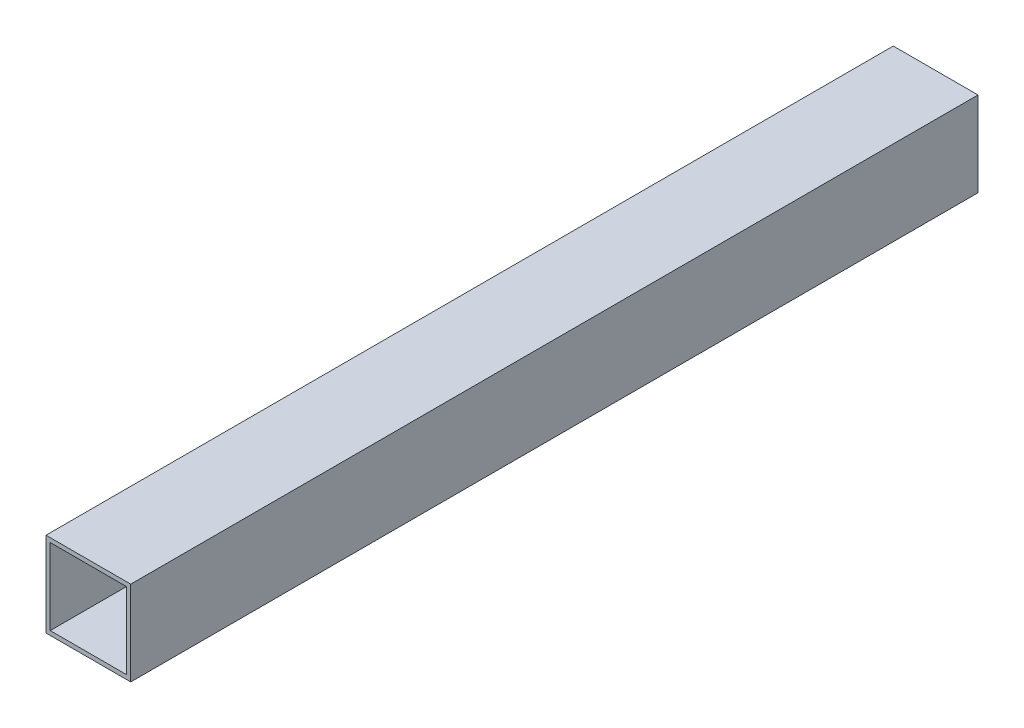
ISO-10303-21;
HEADER;
FILE_DESCRIPTION(('STEP AP214'),'2;1');
FILE_NAME('part.step','',(''),(''),'','','');
FILE_SCHEMA(('AUTOMOTIVE_DESIGN { 1 0 10303 214 1 1 1 1 }'));
ENDSEC;
DATA;
#1=APPLICATION_CONTEXT('core data for automotive mechanical design processes');
#2=APPLICATION_PROTOCOL_DEFINITION('international standard','automotive_design',2000,#1);
#3=PRODUCT_CONTEXT('',#1,'mechanical');
#4=PRODUCT('Part','Part','',(#3));
#5=PRODUCT_RELATED_PRODUCT_CATEGORY('part','',(#4));
#6=PRODUCT_DEFINITION_FORMATION('','',#4);
#7=PRODUCT_DEFINITION_CONTEXT('part definition',#1,'design');
#8=PRODUCT_DEFINITION('design','',#6,#7);
#9=PRODUCT_DEFINITION_SHAPE('','',#8);
#10=(LENGTH_UNIT() NAMED_UNIT(*) SI_UNIT(.MILLI.,.METRE.));
#11=(NAMED_UNIT(*) PLANE_ANGLE_UNIT() SI_UNIT($,.RADIAN.));
#12=(NAMED_UNIT(*) SI_UNIT($,.STERADIAN.) SOLID_ANGLE_UNIT());
#13=UNCERTAINTY_MEASURE_WITH_UNIT(LENGTH_MEASURE(1.E-05),#10,'distance_accuracy_value','');
#14=(GEOMETRIC_REPRESENTATION_CONTEXT(3) GLOBAL_UNCERTAINTY_ASSIGNED_CONTEXT((#13)) GLOBAL_UNIT_ASSIGNED_CONTEXT((#10,
#11,#12)) REPRESENTATION_CONTEXT('',''));
#15=CARTESIAN_POINT('',(0.,0.,0.));
#16=DIRECTION('',(0.,0.,1.));
#17=DIRECTION('',(1.,0.,0.));
#18=AXIS2_PLACEMENT_3D('',#15,#16,#17);
#19=CARTESIAN_POINT('',(0.,0.,500.));
#20=DIRECTION('',(0.,0.,-1.));
#21=DIRECTION('',(-1.,0.,0.));
#22=AXIS2_PLACEMENT_3D('',#19,#20,#21);
#23=PLANE('',#22);
#24=DIRECTION('',(0.,-1.,0.));
#25=VECTOR('',#24,1.);
#26=CARTESIAN_POINT('',(-50.,-50.,500.));
#27=LINE('',#26,#25);
#28=CARTESIAN_POINT('',(-50.,49.9999999999999,500.));
#29=VERTEX_POINT('',#28);
#30=CARTESIAN_POINT('',(-50.,-50.,500.));
#31=VERTEX_POINT('',#30);
#32=EDGE_CURVE('E139',#29,#31,#27,.T.);
#33=ORIENTED_EDGE('',*,*,#32,.T.);
#34=DIRECTION('',(1.,0.,0.));
#35=VECTOR('',#34,1.);
#36=CARTESIAN_POINT('',(-50.,-50.,500.));
#37=LINE('',#36,#35);
#38=CARTESIAN_POINT('',(50.,-50.,500.));
#39=VERTEX_POINT('',#38);
#40=EDGE_CURVE('E142',#31,#39,#37,.T.);
#41=ORIENTED_EDGE('',*,*,#40,.T.);
#42=DIRECTION('',(0.,1.,0.));
#43=VECTOR('',#42,1.);
#44=CARTESIAN_POINT('',(50.,-50.,500.));
#45=LINE('',#44,#43);
#46=CARTESIAN_POINT('',(49.9999999999999,49.9999999999999,500.));
#47=VERTEX_POINT('',#46);
#48=EDGE_CURVE('E147',#39,#47,#45,.T.);
#49=ORIENTED_EDGE('',*,*,#48,.T.);
#50=DIRECTION('',(-1.,0.,0.));
#51=VECTOR('',#50,1.);
#52=CARTESIAN_POINT('',(-50.,49.9999999999999,500.));
#53=LINE('',#52,#51);
#54=EDGE_CURVE('E149',#47,#29,#53,.T.);
#55=ORIENTED_EDGE('',*,*,#54,.T.);
#56=EDGE_LOOP('',(#33,#41,#49,#55));
#57=FACE_BOUND('',#56,.T.);
#58=DIRECTION('',(0.,-1.,0.));
#59=VECTOR('',#58,1.);
#60=CARTESIAN_POINT('',(-45.,-45.,500.));
#61=LINE('',#60,#59);
#62=CARTESIAN_POINT('',(-45.,44.9999999999999,500.));
#63=VERTEX_POINT('',#62);
#64=CARTESIAN_POINT('',(-45.,-45.,500.));
#65=VERTEX_POINT('',#64);
#66=EDGE_CURVE('E101',#63,#65,#61,.T.);
#67=ORIENTED_EDGE('',*,*,#66,.F.);
#68=DIRECTION('',(-1.,0.,0.));
#69=VECTOR('',#68,1.);
#70=CARTESIAN_POINT('',(-45.,44.9999999999999,500.));
#71=LINE('',#70,#69);
#72=CARTESIAN_POINT('',(45.,44.9999999999999,500.));
#73=VERTEX_POINT('',#72);
#74=EDGE_CURVE('E128',#73,#63,#71,.T.);
#75=ORIENTED_EDGE('',*,*,#74,.F.);
#76=DIRECTION('',(0.,1.,0.));
#77=VECTOR('',#76,1.);
#78=CARTESIAN_POINT('',(45.,-45.,500.));
#79=LINE('',#78,#77);
#80=CARTESIAN_POINT('',(45.,-45.,500.));
#81=VERTEX_POINT('',#80);
#82=EDGE_CURVE('E125',#81,#73,#79,.T.);
#83=ORIENTED_EDGE('',*,*,#82,.F.);
#84=DIRECTION('',(1.,0.,0.));
#85=VECTOR('',#84,1.);
#86=CARTESIAN_POINT('',(-45.,-45.,500.));
#87=LINE('',#86,#85);
#88=EDGE_CURVE('E115',#65,#81,#87,.T.);
#89=ORIENTED_EDGE('',*,*,#88,.F.);
#90=EDGE_LOOP('',(#67,#75,#83,#89));
#91=FACE_BOUND('',#90,.T.);
#92=ADVANCED_FACE('F39',(#57,#91),#23,.F.);
#93=CARTESIAN_POINT('',(0.,0.,-500.));
#94=DIRECTION('',(0.,0.,-1.));
#95=DIRECTION('',(-1.,0.,0.));
#96=AXIS2_PLACEMENT_3D('',#93,#94,#95);
#97=PLANE('',#96);
#98=DIRECTION('',(0.,-1.,0.));
#99=VECTOR('',#98,1.);
#100=CARTESIAN_POINT('',(-50.,-50.,-500.));
#101=LINE('',#100,#99);
#102=CARTESIAN_POINT('',(-50.,49.9999999999999,-500.));
#103=VERTEX_POINT('',#102);
#104=CARTESIAN_POINT('',(-50.,-50.,-500.));
#105=VERTEX_POINT('',#104);
#106=EDGE_CURVE('E117',#103,#105,#101,.T.);
#107=ORIENTED_EDGE('',*,*,#106,.F.);
#108=DIRECTION('',(-1.,0.,0.));
#109=VECTOR('',#108,1.);
#110=CARTESIAN_POINT('',(-50.,49.9999999999999,-500.));
#111=LINE('',#110,#109);
#112=CARTESIAN_POINT('',(49.9999999999999,49.9999999999999,-500.));
#113=VERTEX_POINT('',#112);
#114=EDGE_CURVE('E143',#113,#103,#111,.T.);
#115=ORIENTED_EDGE('',*,*,#114,.F.);
#116=DIRECTION('',(0.,1.,0.));
#117=VECTOR('',#116,1.);
#118=CARTESIAN_POINT('',(50.,-50.,-500.));
#119=LINE('',#118,#117);
#120=CARTESIAN_POINT('',(50.,-50.,-500.));
#121=VERTEX_POINT('',#120);
#122=EDGE_CURVE('E153',#121,#113,#119,.T.);
#123=ORIENTED_EDGE('',*,*,#122,.F.);
#124=DIRECTION('',(1.,0.,0.));
#125=VECTOR('',#124,1.);
#126=CARTESIAN_POINT('',(-50.,-50.,-500.));
#127=LINE('',#126,#125);
#128=EDGE_CURVE('E155',#105,#121,#127,.T.);
#129=ORIENTED_EDGE('',*,*,#128,.F.);
#130=EDGE_LOOP('',(#107,#115,#123,#129));
#131=FACE_BOUND('',#130,.T.);
#132=DIRECTION('',(-1.,0.,0.));
#133=VECTOR('',#132,1.);
#134=CARTESIAN_POINT('',(-45.,44.9999999999999,-500.));
#135=LINE('',#134,#133);
#136=CARTESIAN_POINT('',(45.,44.9999999999999,-500.));
#137=VERTEX_POINT('',#136);
#138=CARTESIAN_POINT('',(-45.,44.9999999999999,-500.));
#139=VERTEX_POINT('',#138);
#140=EDGE_CURVE('E111',#137,#139,#135,.T.);
#141=ORIENTED_EDGE('',*,*,#140,.T.);
#142=DIRECTION('',(0.,-1.,0.));
#143=VECTOR('',#142,1.);
#144=CARTESIAN_POINT('',(-45.,-45.,-500.));
#145=LINE('',#144,#143);
#146=CARTESIAN_POINT('',(-45.,-45.,-500.));
#147=VERTEX_POINT('',#146);
#148=EDGE_CURVE('E64',#139,#147,#145,.T.);
#149=ORIENTED_EDGE('',*,*,#148,.T.);
#150=DIRECTION('',(1.,0.,0.));
#151=VECTOR('',#150,1.);
#152=CARTESIAN_POINT('',(-45.,-45.,-500.));
#153=LINE('',#152,#151);
#154=CARTESIAN_POINT('',(45.,-45.,-500.));
#155=VERTEX_POINT('',#154);
#156=EDGE_CURVE('E119',#147,#155,#153,.T.);
#157=ORIENTED_EDGE('',*,*,#156,.T.);
#158=DIRECTION('',(0.,1.,0.));
#159=VECTOR('',#158,1.);
#160=CARTESIAN_POINT('',(45.,-45.,-500.));
#161=LINE('',#160,#159);
#162=EDGE_CURVE('E135',#155,#137,#161,.T.);
#163=ORIENTED_EDGE('',*,*,#162,.T.);
#164=EDGE_LOOP('',(#141,#149,#157,#163));
#165=FACE_BOUND('',#164,.T.);
#166=ADVANCED_FACE('F171',(#131,#165),#97,.T.);
#167=CARTESIAN_POINT('',(-50.,-50.,500.));
#168=DIRECTION('',(1.,0.,0.));
#169=DIRECTION('',(0.,0.,-1.));
#170=AXIS2_PLACEMENT_3D('',#167,#168,#169);
#171=PLANE('',#170);
#172=ORIENTED_EDGE('',*,*,#106,.T.);
#173=DIRECTION('',(0.,0.,-1.));
#174=VECTOR('',#173,1.);
#175=CARTESIAN_POINT('',(-50.,-50.,500.));
#176=LINE('',#175,#174);
#177=EDGE_CURVE('E11',#31,#105,#176,.T.);
#178=ORIENTED_EDGE('',*,*,#177,.F.);
#179=ORIENTED_EDGE('',*,*,#32,.F.);
#180=DIRECTION('',(0.,0.,-1.));
#181=VECTOR('',#180,1.);
#182=CARTESIAN_POINT('',(-50.,49.9999999999999,500.));
#183=LINE('',#182,#181);
#184=EDGE_CURVE('E148',#29,#103,#183,.T.);
#185=ORIENTED_EDGE('',*,*,#184,.T.);
#186=EDGE_LOOP('',(#172,#178,#179,#185));
#187=FACE_BOUND('',#186,.T.);
#188=ADVANCED_FACE('F41',(#187),#171,.F.);
#189=CARTESIAN_POINT('',(-50.,-50.,500.));
#190=DIRECTION('',(0.,1.,0.));
#191=DIRECTION('',(0.,0.,1.));
#192=AXIS2_PLACEMENT_3D('',#189,#190,#191);
#193=PLANE('',#192);
#194=ORIENTED_EDGE('',*,*,#128,.T.);
#195=DIRECTION('',(0.,0.,-1.));
#196=VECTOR('',#195,1.);
#197=CARTESIAN_POINT('',(50.,-50.,500.));
#198=LINE('',#197,#196);
#199=EDGE_CURVE('E50',#39,#121,#198,.T.);
#200=ORIENTED_EDGE('',*,*,#199,.F.);
#201=ORIENTED_EDGE('',*,*,#40,.F.);
#202=ORIENTED_EDGE('',*,*,#177,.T.);
#203=EDGE_LOOP('',(#194,#200,#201,#202));
#204=FACE_BOUND('',#203,.T.);
#205=ADVANCED_FACE('F183',(#204),#193,.F.);
#206=CARTESIAN_POINT('',(50.,-50.,500.));
#207=DIRECTION('',(-1.,0.,0.));
#208=DIRECTION('',(0.,-1.,0.));
#209=AXIS2_PLACEMENT_3D('',#206,#207,#208);
#210=PLANE('',#209);
#211=ORIENTED_EDGE('',*,*,#122,.T.);
#212=DIRECTION('',(0.,0.,-1.));
#213=VECTOR('',#212,1.);
#214=CARTESIAN_POINT('',(49.9999999999999,49.9999999999999,500.));
#215=LINE('',#214,#213);
#216=EDGE_CURVE('E158',#47,#113,#215,.T.);
#217=ORIENTED_EDGE('',*,*,#216,.F.);
#218=ORIENTED_EDGE('',*,*,#48,.F.);
#219=ORIENTED_EDGE('',*,*,#199,.T.);
#220=EDGE_LOOP('',(#211,#217,#218,#219));
#221=FACE_BOUND('',#220,.T.);
#222=ADVANCED_FACE('F167',(#221),#210,.F.);
#223=CARTESIAN_POINT('',(-50.,49.9999999999999,500.));
#224=DIRECTION('',(0.,-1.,0.));
#225=DIRECTION('',(0.,0.,-1.));
#226=AXIS2_PLACEMENT_3D('',#223,#224,#225);
#227=PLANE('',#226);
#228=ORIENTED_EDGE('',*,*,#114,.T.);
#229=ORIENTED_EDGE('',*,*,#184,.F.);
#230=ORIENTED_EDGE('',*,*,#54,.F.);
#231=ORIENTED_EDGE('',*,*,#216,.T.);
#232=EDGE_LOOP('',(#228,#229,#230,#231));
#233=FACE_BOUND('',#232,.T.);
#234=ADVANCED_FACE('F180',(#233),#227,.F.);
#235=CARTESIAN_POINT('',(-45.,-45.,500.));
#236=DIRECTION('',(1.,0.,0.));
#237=DIRECTION('',(0.,0.,-1.));
#238=AXIS2_PLACEMENT_3D('',#235,#236,#237);
#239=PLANE('',#238);
#240=ORIENTED_EDGE('',*,*,#148,.F.);
#241=DIRECTION('',(0.,0.,-1.));
#242=VECTOR('',#241,1.);
#243=CARTESIAN_POINT('',(-45.,44.9999999999999,500.));
#244=LINE('',#243,#242);
#245=EDGE_CURVE('E110',#63,#139,#244,.T.);
#246=ORIENTED_EDGE('',*,*,#245,.F.);
#247=ORIENTED_EDGE('',*,*,#66,.T.);
#248=DIRECTION('',(0.,0.,-1.));
#249=VECTOR('',#248,1.);
#250=CARTESIAN_POINT('',(-45.,-45.,500.));
#251=LINE('',#250,#249);
#252=EDGE_CURVE('E109',#65,#147,#251,.T.);
#253=ORIENTED_EDGE('',*,*,#252,.T.);
#254=EDGE_LOOP('',(#240,#246,#247,#253));
#255=FACE_BOUND('',#254,.T.);
#256=ADVANCED_FACE('F107',(#255),#239,.T.);
#257=CARTESIAN_POINT('',(-45.,-45.,500.));
#258=DIRECTION('',(0.,1.,0.));
#259=DIRECTION('',(0.,0.,1.));
#260=AXIS2_PLACEMENT_3D('',#257,#258,#259);
#261=PLANE('',#260);
#262=ORIENTED_EDGE('',*,*,#156,.F.);
#263=ORIENTED_EDGE('',*,*,#252,.F.);
#264=ORIENTED_EDGE('',*,*,#88,.T.);
#265=DIRECTION('',(0.,0.,-1.));
#266=VECTOR('',#265,1.);
#267=CARTESIAN_POINT('',(45.,-45.,500.));
#268=LINE('',#267,#266);
#269=EDGE_CURVE('E123',#81,#155,#268,.T.);
#270=ORIENTED_EDGE('',*,*,#269,.T.);
#271=EDGE_LOOP('',(#262,#263,#264,#270));
#272=FACE_BOUND('',#271,.T.);
#273=ADVANCED_FACE('F118',(#272),#261,.T.);
#274=CARTESIAN_POINT('',(45.,-45.,500.));
#275=DIRECTION('',(-1.,0.,0.));
#276=DIRECTION('',(0.,-1.,0.));
#277=AXIS2_PLACEMENT_3D('',#274,#275,#276);
#278=PLANE('',#277);
#279=ORIENTED_EDGE('',*,*,#162,.F.);
#280=ORIENTED_EDGE('',*,*,#269,.F.);
#281=ORIENTED_EDGE('',*,*,#82,.T.);
#282=DIRECTION('',(0.,0.,-1.));
#283=VECTOR('',#282,1.);
#284=CARTESIAN_POINT('',(45.,44.9999999999999,500.));
#285=LINE('',#284,#283);
#286=EDGE_CURVE('E53',#73,#137,#285,.T.);
#287=ORIENTED_EDGE('',*,*,#286,.T.);
#288=EDGE_LOOP('',(#279,#280,#281,#287));
#289=FACE_BOUND('',#288,.T.);
#290=ADVANCED_FACE('F208',(#289),#278,.T.);
#291=CARTESIAN_POINT('',(-45.,44.9999999999999,500.));
#292=DIRECTION('',(0.,-1.,0.));
#293=DIRECTION('',(0.,0.,-1.));
#294=AXIS2_PLACEMENT_3D('',#291,#292,#293);
#295=PLANE('',#294);
#296=ORIENTED_EDGE('',*,*,#140,.F.);
#297=ORIENTED_EDGE('',*,*,#286,.F.);
#298=ORIENTED_EDGE('',*,*,#74,.T.);
#299=ORIENTED_EDGE('',*,*,#245,.T.);
#300=EDGE_LOOP('',(#296,#297,#298,#299));
#301=FACE_BOUND('',#300,.T.);
#302=ADVANCED_FACE('F207',(#301),#295,.T.);
#303=CLOSED_SHELL('',(#92,#166,#188,#205,#222,#234,#256,#273,#290,#302));
#304=MANIFOLD_SOLID_BREP('B2',#303);
#305=ADVANCED_BREP_SHAPE_REPRESENTATION('',(#18,#304),#14);
#306=SHAPE_DEFINITION_REPRESENTATION(#9,#305);
ENDSEC;
END-ISO-10303-21;
